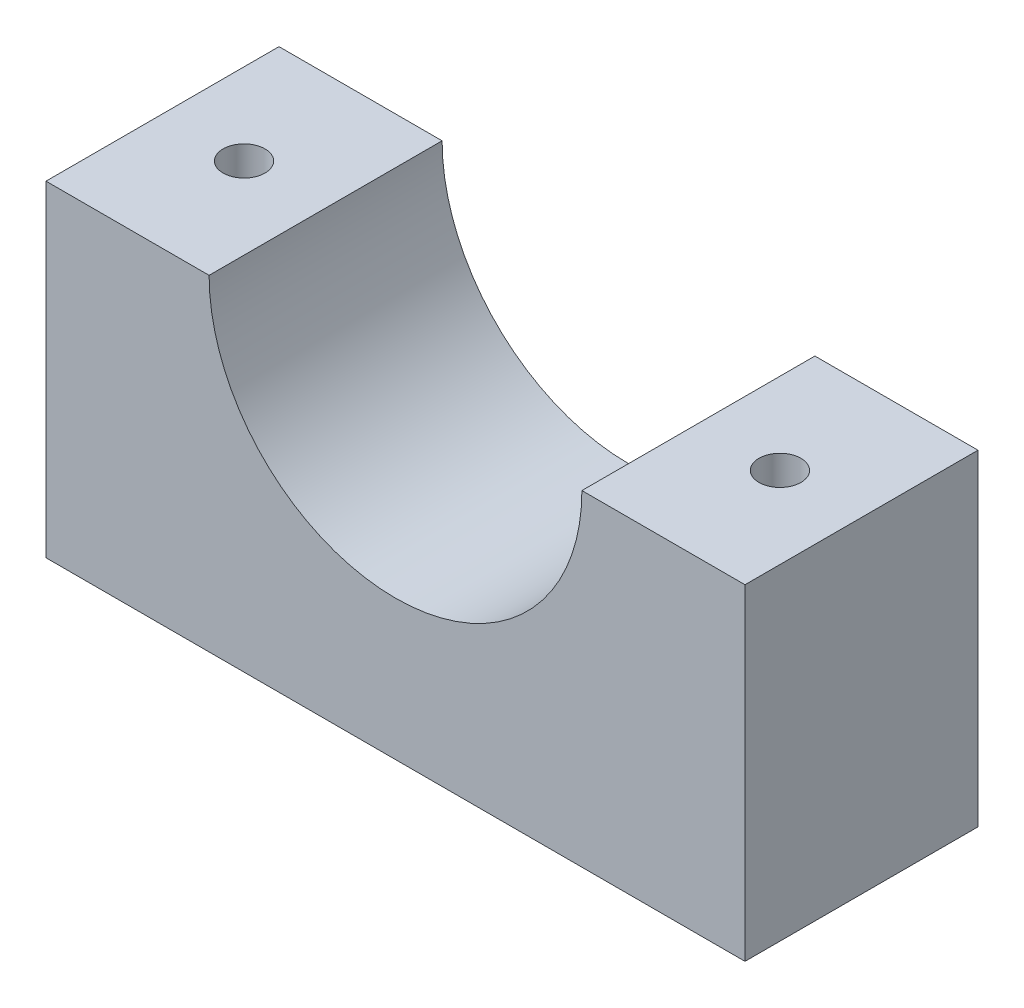
ISO-10303-21;
HEADER;
FILE_DESCRIPTION(('STEP AP214'),'2;1');
FILE_NAME('part.step','',(''),(''),'','','');
FILE_SCHEMA(('AUTOMOTIVE_DESIGN { 1 0 10303 214 1 1 1 1 }'));
ENDSEC;
DATA;
#1=APPLICATION_CONTEXT('core data for automotive mechanical design processes');
#2=APPLICATION_PROTOCOL_DEFINITION('international standard','automotive_design',2000,#1);
#3=PRODUCT_CONTEXT('',#1,'mechanical');
#4=PRODUCT('Part','Part','',(#3));
#5=PRODUCT_RELATED_PRODUCT_CATEGORY('part','',(#4));
#6=PRODUCT_DEFINITION_FORMATION('','',#4);
#7=PRODUCT_DEFINITION_CONTEXT('part definition',#1,'design');
#8=PRODUCT_DEFINITION('design','',#6,#7);
#9=PRODUCT_DEFINITION_SHAPE('','',#8);
#10=(LENGTH_UNIT() NAMED_UNIT(*) SI_UNIT(.MILLI.,.METRE.));
#11=(NAMED_UNIT(*) PLANE_ANGLE_UNIT() SI_UNIT($,.RADIAN.));
#12=(NAMED_UNIT(*) SI_UNIT($,.STERADIAN.) SOLID_ANGLE_UNIT());
#13=UNCERTAINTY_MEASURE_WITH_UNIT(LENGTH_MEASURE(1.E-05),#10,'distance_accuracy_value','');
#14=(GEOMETRIC_REPRESENTATION_CONTEXT(3) GLOBAL_UNCERTAINTY_ASSIGNED_CONTEXT((#13)) GLOBAL_UNIT_ASSIGNED_CONTEXT((#10,
#11,#12)) REPRESENTATION_CONTEXT('',''));
#15=CARTESIAN_POINT('',(0.,0.,0.));
#16=DIRECTION('',(0.,0.,1.));
#17=DIRECTION('',(1.,0.,0.));
#18=AXIS2_PLACEMENT_3D('',#15,#16,#17);
#19=CARTESIAN_POINT('',(0.,0.,12.7));
#20=DIRECTION('',(0.,-1.,0.));
#21=DIRECTION('',(0.,0.,-1.));
#22=AXIS2_PLACEMENT_3D('',#19,#20,#21);
#23=PLANE('',#22);
#24=CARTESIAN_POINT('',(33.655,0.,6.35));
#25=DIRECTION('',(0.,1.,0.));
#26=DIRECTION('',(0.,0.,1.));
#27=AXIS2_PLACEMENT_3D('',#24,#25,#26);
#28=CIRCLE('',#27,1.143);
#29=CARTESIAN_POINT('',(33.655,0.,7.493));
#30=VERTEX_POINT('',#29);
#31=EDGE_CURVE('E142',#30,#30,#28,.T.);
#32=ORIENTED_EDGE('',*,*,#31,.F.);
#33=EDGE_LOOP('',(#32));
#34=FACE_BOUND('',#33,.T.);
#35=DIRECTION('',(-1.,0.,0.));
#36=VECTOR('',#35,1.);
#37=CARTESIAN_POINT('',(0.,0.,0.));
#38=LINE('',#37,#36);
#39=CARTESIAN_POINT('',(38.1,0.,0.));
#40=VERTEX_POINT('',#39);
#41=CARTESIAN_POINT('',(29.21,0.,0.));
#42=VERTEX_POINT('',#41);
#43=EDGE_CURVE('E106',#40,#42,#38,.T.);
#44=ORIENTED_EDGE('',*,*,#43,.T.);
#45=DIRECTION('',(0.,0.,1.));
#46=VECTOR('',#45,1.);
#47=CARTESIAN_POINT('',(29.21,0.,0.));
#48=LINE('',#47,#46);
#49=CARTESIAN_POINT('',(29.21,0.,12.7));
#50=VERTEX_POINT('',#49);
#51=EDGE_CURVE('E47',#42,#50,#48,.T.);
#52=ORIENTED_EDGE('',*,*,#51,.T.);
#53=DIRECTION('',(-1.,0.,0.));
#54=VECTOR('',#53,1.);
#55=CARTESIAN_POINT('',(0.,0.,12.7));
#56=LINE('',#55,#54);
#57=CARTESIAN_POINT('',(38.1,0.,12.7));
#58=VERTEX_POINT('',#57);
#59=EDGE_CURVE('E117',#58,#50,#56,.T.);
#60=ORIENTED_EDGE('',*,*,#59,.F.);
#61=DIRECTION('',(0.,0.,-1.));
#62=VECTOR('',#61,1.);
#63=CARTESIAN_POINT('',(38.1,0.,12.7));
#64=LINE('',#63,#62);
#65=EDGE_CURVE('E116',#58,#40,#64,.T.);
#66=ORIENTED_EDGE('',*,*,#65,.T.);
#67=EDGE_LOOP('',(#44,#52,#60,#66));
#68=FACE_BOUND('',#67,.T.);
#69=ADVANCED_FACE('F32',(#34,#68),#23,.F.);
#70=CARTESIAN_POINT('',(0.,0.,12.7));
#71=DIRECTION('',(1.,0.,0.));
#72=DIRECTION('',(0.,1.,0.));
#73=AXIS2_PLACEMENT_3D('',#70,#71,#72);
#74=PLANE('',#73);
#75=DIRECTION('',(0.,-1.,0.));
#76=VECTOR('',#75,1.);
#77=CARTESIAN_POINT('',(0.,0.,0.));
#78=LINE('',#77,#76);
#79=CARTESIAN_POINT('',(0.,0.,0.));
#80=VERTEX_POINT('',#79);
#81=CARTESIAN_POINT('',(0.,-17.78,0.));
#82=VERTEX_POINT('',#81);
#83=EDGE_CURVE('E105',#80,#82,#78,.T.);
#84=ORIENTED_EDGE('',*,*,#83,.T.);
#85=DIRECTION('',(0.,0.,-1.));
#86=VECTOR('',#85,1.);
#87=CARTESIAN_POINT('',(0.,-17.78,12.7));
#88=LINE('',#87,#86);
#89=CARTESIAN_POINT('',(0.,-17.78,12.7));
#90=VERTEX_POINT('',#89);
#91=EDGE_CURVE('E11',#90,#82,#88,.T.);
#92=ORIENTED_EDGE('',*,*,#91,.F.);
#93=DIRECTION('',(0.,-1.,0.));
#94=VECTOR('',#93,1.);
#95=CARTESIAN_POINT('',(0.,0.,12.7));
#96=LINE('',#95,#94);
#97=CARTESIAN_POINT('',(0.,0.,12.7));
#98=VERTEX_POINT('',#97);
#99=EDGE_CURVE('E109',#98,#90,#96,.T.);
#100=ORIENTED_EDGE('',*,*,#99,.F.);
#101=DIRECTION('',(0.,0.,-1.));
#102=VECTOR('',#101,1.);
#103=CARTESIAN_POINT('',(0.,0.,12.7));
#104=LINE('',#103,#102);
#105=EDGE_CURVE('E114',#98,#80,#104,.T.);
#106=ORIENTED_EDGE('',*,*,#105,.T.);
#107=EDGE_LOOP('',(#84,#92,#100,#106));
#108=FACE_BOUND('',#107,.T.);
#109=ADVANCED_FACE('F34',(#108),#74,.F.);
#110=CARTESIAN_POINT('',(0.,-17.78,12.7));
#111=DIRECTION('',(0.,1.,0.));
#112=DIRECTION('',(0.,0.,1.));
#113=AXIS2_PLACEMENT_3D('',#110,#111,#112);
#114=PLANE('',#113);
#115=CARTESIAN_POINT('',(4.445,-17.78,6.35));
#116=DIRECTION('',(0.,1.,0.));
#117=DIRECTION('',(0.,0.,1.));
#118=AXIS2_PLACEMENT_3D('',#115,#116,#117);
#119=CIRCLE('',#118,1.143);
#120=CARTESIAN_POINT('',(4.445,-17.78,7.493));
#121=VERTEX_POINT('',#120);
#122=EDGE_CURVE('E140',#121,#121,#119,.T.);
#123=ORIENTED_EDGE('',*,*,#122,.T.);
#124=EDGE_LOOP('',(#123));
#125=FACE_BOUND('',#124,.T.);
#126=CARTESIAN_POINT('',(33.655,-17.78,6.35));
#127=DIRECTION('',(0.,1.,0.));
#128=DIRECTION('',(0.,0.,1.));
#129=AXIS2_PLACEMENT_3D('',#126,#127,#128);
#130=CIRCLE('',#129,1.143);
#131=CARTESIAN_POINT('',(33.655,-17.78,7.493));
#132=VERTEX_POINT('',#131);
#133=EDGE_CURVE('E145',#132,#132,#130,.T.);
#134=ORIENTED_EDGE('',*,*,#133,.T.);
#135=EDGE_LOOP('',(#134));
#136=FACE_BOUND('',#135,.T.);
#137=DIRECTION('',(1.,0.,0.));
#138=VECTOR('',#137,1.);
#139=CARTESIAN_POINT('',(0.,-17.78,0.));
#140=LINE('',#139,#138);
#141=CARTESIAN_POINT('',(38.1,-17.78,0.));
#142=VERTEX_POINT('',#141);
#143=EDGE_CURVE('E110',#82,#142,#140,.T.);
#144=ORIENTED_EDGE('',*,*,#143,.T.);
#145=DIRECTION('',(0.,0.,-1.));
#146=VECTOR('',#145,1.);
#147=CARTESIAN_POINT('',(38.1,-17.78,12.7));
#148=LINE('',#147,#146);
#149=CARTESIAN_POINT('',(38.1,-17.78,12.7));
#150=VERTEX_POINT('',#149);
#151=EDGE_CURVE('E40',#150,#142,#148,.T.);
#152=ORIENTED_EDGE('',*,*,#151,.F.);
#153=DIRECTION('',(1.,0.,0.));
#154=VECTOR('',#153,1.);
#155=CARTESIAN_POINT('',(0.,-17.78,12.7));
#156=LINE('',#155,#154);
#157=EDGE_CURVE('E85',#90,#150,#156,.T.);
#158=ORIENTED_EDGE('',*,*,#157,.F.);
#159=ORIENTED_EDGE('',*,*,#91,.T.);
#160=EDGE_LOOP('',(#144,#152,#158,#159));
#161=FACE_BOUND('',#160,.T.);
#162=ADVANCED_FACE('F133',(#125,#136,#161),#114,.F.);
#163=CARTESIAN_POINT('',(38.1,0.,12.7));
#164=DIRECTION('',(-1.,0.,0.));
#165=DIRECTION('',(0.,0.,1.));
#166=AXIS2_PLACEMENT_3D('',#163,#164,#165);
#167=PLANE('',#166);
#168=DIRECTION('',(0.,1.,0.));
#169=VECTOR('',#168,1.);
#170=CARTESIAN_POINT('',(38.1,0.,0.));
#171=LINE('',#170,#169);
#172=EDGE_CURVE('E107',#142,#40,#171,.T.);
#173=ORIENTED_EDGE('',*,*,#172,.T.);
#174=ORIENTED_EDGE('',*,*,#65,.F.);
#175=DIRECTION('',(0.,1.,0.));
#176=VECTOR('',#175,1.);
#177=CARTESIAN_POINT('',(38.1,0.,12.7));
#178=LINE('',#177,#176);
#179=EDGE_CURVE('E125',#150,#58,#178,.T.);
#180=ORIENTED_EDGE('',*,*,#179,.F.);
#181=ORIENTED_EDGE('',*,*,#151,.T.);
#182=EDGE_LOOP('',(#173,#174,#180,#181));
#183=FACE_BOUND('',#182,.T.);
#184=ADVANCED_FACE('F123',(#183),#167,.F.);
#185=CARTESIAN_POINT('',(4.445,0.,6.35));
#186=DIRECTION('',(0.,1.,0.));
#187=DIRECTION('',(0.,0.,1.));
#188=AXIS2_PLACEMENT_3D('',#185,#186,#187);
#189=CIRCLE('',#188,1.143);
#190=CARTESIAN_POINT('',(4.445,0.,7.493));
#191=VERTEX_POINT('',#190);
#192=EDGE_CURVE('E148',#191,#191,#189,.T.);
#193=ORIENTED_EDGE('',*,*,#192,.F.);
#194=EDGE_LOOP('',(#193));
#195=FACE_BOUND('',#194,.T.);
#196=CARTESIAN_POINT('',(8.89,0.,12.7));
#197=VERTEX_POINT('',#196);
#198=EDGE_CURVE('E56',#197,#98,#56,.T.);
#199=ORIENTED_EDGE('',*,*,#198,.F.);
#200=DIRECTION('',(0.,0.,1.));
#201=VECTOR('',#200,1.);
#202=CARTESIAN_POINT('',(8.89,0.,0.));
#203=LINE('',#202,#201);
#204=CARTESIAN_POINT('',(8.89,0.,0.));
#205=VERTEX_POINT('',#204);
#206=EDGE_CURVE('E94',#205,#197,#203,.T.);
#207=ORIENTED_EDGE('',*,*,#206,.F.);
#208=EDGE_CURVE('E78',#205,#80,#38,.T.);
#209=ORIENTED_EDGE('',*,*,#208,.T.);
#210=ORIENTED_EDGE('',*,*,#105,.F.);
#211=EDGE_LOOP('',(#199,#207,#209,#210));
#212=FACE_BOUND('',#211,.T.);
#213=ADVANCED_FACE('F100',(#195,#212),#23,.F.);
#214=CARTESIAN_POINT('',(0.,0.,12.7));
#215=DIRECTION('',(0.,0.,1.));
#216=DIRECTION('',(1.,0.,0.));
#217=AXIS2_PLACEMENT_3D('',#214,#215,#216);
#218=PLANE('',#217);
#219=CARTESIAN_POINT('',(19.05,0.,12.7));
#220=DIRECTION('',(0.,0.,1.));
#221=DIRECTION('',(1.,0.,0.));
#222=AXIS2_PLACEMENT_3D('',#219,#220,#221);
#223=CIRCLE('',#222,10.16);
#224=EDGE_CURVE('E98',#197,#50,#223,.T.);
#225=ORIENTED_EDGE('',*,*,#224,.F.);
#226=ORIENTED_EDGE('',*,*,#198,.T.);
#227=ORIENTED_EDGE('',*,*,#99,.T.);
#228=ORIENTED_EDGE('',*,*,#157,.T.);
#229=ORIENTED_EDGE('',*,*,#179,.T.);
#230=ORIENTED_EDGE('',*,*,#59,.T.);
#231=EDGE_LOOP('',(#225,#226,#227,#228,#229,#230));
#232=FACE_BOUND('',#231,.T.);
#233=ADVANCED_FACE('F164',(#232),#218,.T.);
#234=CARTESIAN_POINT('',(0.,0.,0.));
#235=DIRECTION('',(0.,0.,1.));
#236=DIRECTION('',(1.,0.,0.));
#237=AXIS2_PLACEMENT_3D('',#234,#235,#236);
#238=PLANE('',#237);
#239=ORIENTED_EDGE('',*,*,#208,.F.);
#240=CARTESIAN_POINT('',(19.05,0.,0.));
#241=DIRECTION('',(0.,0.,1.));
#242=DIRECTION('',(1.,0.,0.));
#243=AXIS2_PLACEMENT_3D('',#240,#241,#242);
#244=CIRCLE('',#243,10.16);
#245=EDGE_CURVE('E92',#205,#42,#244,.T.);
#246=ORIENTED_EDGE('',*,*,#245,.T.);
#247=ORIENTED_EDGE('',*,*,#43,.F.);
#248=ORIENTED_EDGE('',*,*,#172,.F.);
#249=ORIENTED_EDGE('',*,*,#143,.F.);
#250=ORIENTED_EDGE('',*,*,#83,.F.);
#251=EDGE_LOOP('',(#239,#246,#247,#248,#249,#250));
#252=FACE_BOUND('',#251,.T.);
#253=ADVANCED_FACE('F103',(#252),#238,.F.);
#254=CARTESIAN_POINT('',(19.05,0.,0.));
#255=DIRECTION('',(0.,0.,1.));
#256=DIRECTION('',(1.,0.,0.));
#257=AXIS2_PLACEMENT_3D('',#254,#255,#256);
#258=CYLINDRICAL_SURFACE('',#257,10.16);
#259=ORIENTED_EDGE('',*,*,#224,.T.);
#260=ORIENTED_EDGE('',*,*,#51,.F.);
#261=ORIENTED_EDGE('',*,*,#245,.F.);
#262=ORIENTED_EDGE('',*,*,#206,.T.);
#263=EDGE_LOOP('',(#259,#260,#261,#262));
#264=FACE_BOUND('',#263,.T.);
#265=ADVANCED_FACE('F93',(#264),#258,.F.);
#266=CARTESIAN_POINT('',(4.445,-17.78,6.35));
#267=DIRECTION('',(0.,1.,0.));
#268=DIRECTION('',(0.,0.,1.));
#269=AXIS2_PLACEMENT_3D('',#266,#267,#268);
#270=CYLINDRICAL_SURFACE('',#269,1.143);
#271=ORIENTED_EDGE('',*,*,#122,.F.);
#272=EDGE_LOOP('',(#271));
#273=FACE_BOUND('',#272,.T.);
#274=ORIENTED_EDGE('',*,*,#192,.T.);
#275=EDGE_LOOP('',(#274));
#276=FACE_BOUND('',#275,.T.);
#277=ADVANCED_FACE('F156',(#273,#276),#270,.F.);
#278=CARTESIAN_POINT('',(33.655,-17.78,6.35));
#279=DIRECTION('',(0.,1.,0.));
#280=DIRECTION('',(0.,0.,1.));
#281=AXIS2_PLACEMENT_3D('',#278,#279,#280);
#282=CYLINDRICAL_SURFACE('',#281,1.143);
#283=ORIENTED_EDGE('',*,*,#133,.F.);
#284=EDGE_LOOP('',(#283));
#285=FACE_BOUND('',#284,.T.);
#286=ORIENTED_EDGE('',*,*,#31,.T.);
#287=EDGE_LOOP('',(#286));
#288=FACE_BOUND('',#287,.T.);
#289=ADVANCED_FACE('F159',(#285,#288),#282,.F.);
#290=CLOSED_SHELL('',(#69,#109,#162,#184,#213,#233,#253,#265,#277,#289));
#291=MANIFOLD_SOLID_BREP('B2',#290);
#292=ADVANCED_BREP_SHAPE_REPRESENTATION('',(#18,#291),#14);
#293=SHAPE_DEFINITION_REPRESENTATION(#9,#292);
ENDSEC;
END-ISO-10303-21;
